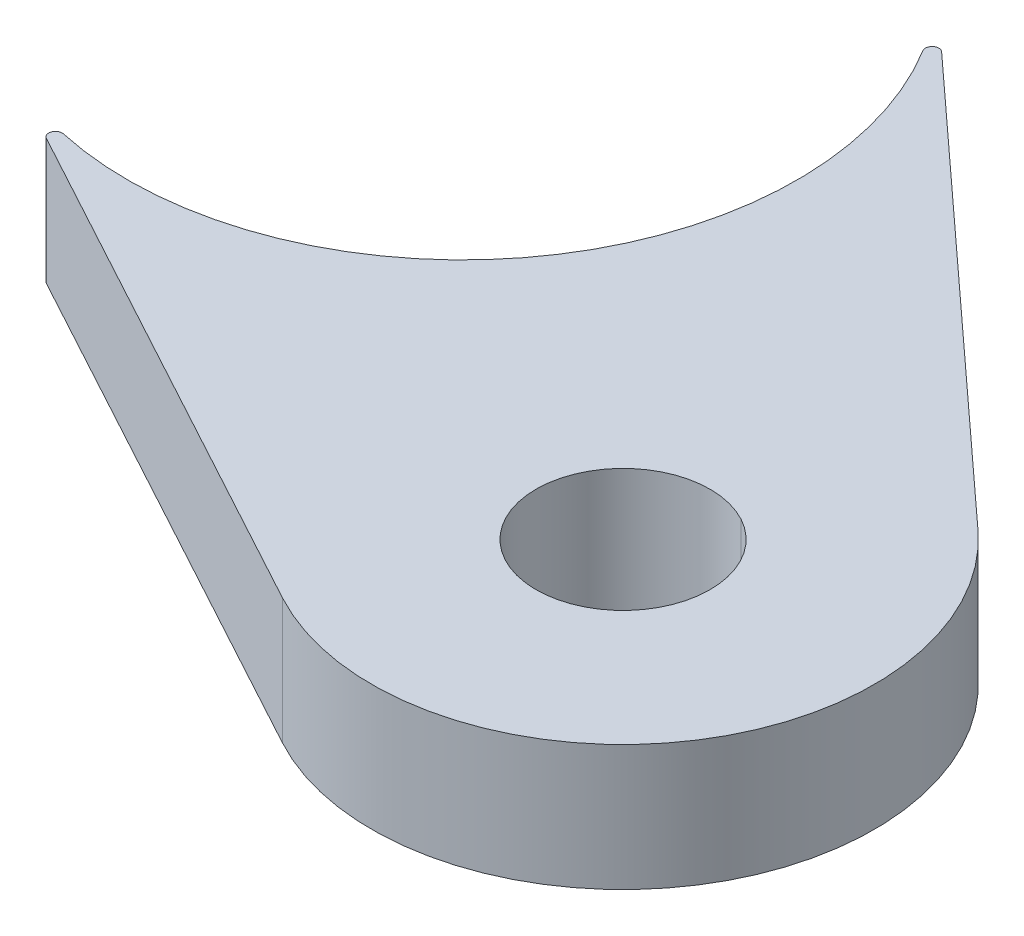
ISO-10303-21;
HEADER;
FILE_DESCRIPTION(('STEP AP214'),'2;1');
FILE_NAME('part.step','',(''),(''),'','','');
FILE_SCHEMA(('AUTOMOTIVE_DESIGN { 1 0 10303 214 1 1 1 1 }'));
ENDSEC;
DATA;
#1=APPLICATION_CONTEXT('core data for automotive mechanical design processes');
#2=APPLICATION_PROTOCOL_DEFINITION('international standard','automotive_design',2000,#1);
#3=PRODUCT_CONTEXT('',#1,'mechanical');
#4=PRODUCT('Part','Part','',(#3));
#5=PRODUCT_RELATED_PRODUCT_CATEGORY('part','',(#4));
#6=PRODUCT_DEFINITION_FORMATION('','',#4);
#7=PRODUCT_DEFINITION_CONTEXT('part definition',#1,'design');
#8=PRODUCT_DEFINITION('design','',#6,#7);
#9=PRODUCT_DEFINITION_SHAPE('','',#8);
#10=(LENGTH_UNIT() NAMED_UNIT(*) SI_UNIT(.MILLI.,.METRE.));
#11=(NAMED_UNIT(*) PLANE_ANGLE_UNIT() SI_UNIT($,.RADIAN.));
#12=(NAMED_UNIT(*) SI_UNIT($,.STERADIAN.) SOLID_ANGLE_UNIT());
#13=UNCERTAINTY_MEASURE_WITH_UNIT(LENGTH_MEASURE(1.E-05),#10,'distance_accuracy_value','');
#14=(GEOMETRIC_REPRESENTATION_CONTEXT(3) GLOBAL_UNCERTAINTY_ASSIGNED_CONTEXT((#13)) GLOBAL_UNIT_ASSIGNED_CONTEXT((#10,
#11,#12)) REPRESENTATION_CONTEXT('',''));
#15=CARTESIAN_POINT('',(0.,0.,0.));
#16=DIRECTION('',(0.,0.,1.));
#17=DIRECTION('',(1.,0.,0.));
#18=AXIS2_PLACEMENT_3D('',#15,#16,#17);
#19=CARTESIAN_POINT('',(21.2002725978992,4.7625,15.1119048029944));
#20=DIRECTION('',(0.,-1.,0.));
#21=DIRECTION('',(0.,0.,-1.));
#22=AXIS2_PLACEMENT_3D('',#19,#20,#21);
#23=CYLINDRICAL_SURFACE('',#22,3.29999999999998);
#24=CARTESIAN_POINT('',(21.2002725978992,4.7625,15.1119048029944));
#25=DIRECTION('',(0.,1.,0.));
#26=DIRECTION('',(0.,0.,1.));
#27=AXIS2_PLACEMENT_3D('',#24,#25,#26);
#28=CIRCLE('',#27,3.29999999999998);
#29=CARTESIAN_POINT('',(22.7737409759033,4.7625,12.2111812271566));
#30=VERTEX_POINT('',#29);
#31=CARTESIAN_POINT('',(19.6268042198951,4.7625,18.0126283788321));
#32=VERTEX_POINT('',#31);
#33=EDGE_CURVE('E159',#30,#32,#28,.T.);
#34=ORIENTED_EDGE('',*,*,#33,.T.);
#35=DIRECTION('',(0.,-1.,0.));
#36=VECTOR('',#35,1.);
#37=CARTESIAN_POINT('',(19.6268042198951,4.7625,18.0126283788321));
#38=LINE('',#37,#36);
#39=CARTESIAN_POINT('',(19.6268042198951,0.,18.0126283788321));
#40=VERTEX_POINT('',#39);
#41=EDGE_CURVE('E11',#32,#40,#38,.T.);
#42=ORIENTED_EDGE('',*,*,#41,.T.);
#43=CARTESIAN_POINT('',(21.2002725978992,0.,15.1119048029944));
#44=DIRECTION('',(0.,1.,0.));
#45=DIRECTION('',(0.,0.,1.));
#46=AXIS2_PLACEMENT_3D('',#43,#44,#45);
#47=CIRCLE('',#46,3.29999999999998);
#48=CARTESIAN_POINT('',(22.7737409759033,0.,12.2111812271566));
#49=VERTEX_POINT('',#48);
#50=EDGE_CURVE('E161',#49,#40,#47,.T.);
#51=ORIENTED_EDGE('',*,*,#50,.F.);
#52=DIRECTION('',(0.,1.,0.));
#53=VECTOR('',#52,1.);
#54=CARTESIAN_POINT('',(22.7737409759033,4.7625,12.2111812271566));
#55=LINE('',#54,#53);
#56=EDGE_CURVE('E51',#49,#30,#55,.T.);
#57=ORIENTED_EDGE('',*,*,#56,.T.);
#58=EDGE_LOOP('',(#34,#42,#51,#57));
#59=FACE_BOUND('',#58,.T.);
#60=ADVANCED_FACE('F42',(#59),#23,.F.);
#61=CARTESIAN_POINT('',(21.2002725978992,4.7625,15.1119048029944));
#62=DIRECTION('',(0.,-1.,0.));
#63=DIRECTION('',(0.,0.,-1.));
#64=AXIS2_PLACEMENT_3D('',#61,#62,#63);
#65=PLANE('',#64);
#66=DIRECTION('',(-0.737435012841057,0.,-0.675418094098841));
#67=VECTOR('',#66,1.);
#68=CARTESIAN_POINT('',(27.6336299441907,4.7625,8.0878363056833));
#69=LINE('',#68,#67);
#70=CARTESIAN_POINT('',(27.6336299441907,4.7625,8.0878363056833));
#71=VERTEX_POINT('',#70);
#72=CARTESIAN_POINT('',(11.2267519102379,4.7625,-6.93925367355661));
#73=VERTEX_POINT('',#72);
#74=EDGE_CURVE('E105',#71,#73,#69,.T.);
#75=ORIENTED_EDGE('',*,*,#74,.T.);
#76=CARTESIAN_POINT('',(11.0551957143368,4.7625,-6.75194518029498));
#77=DIRECTION('',(0.,-1.,0.));
#78=DIRECTION('',(0.,0.,-1.));
#79=AXIS2_PLACEMENT_3D('',#76,#77,#78);
#80=CIRCLE('',#79,0.254);
#81=CARTESIAN_POINT('',(10.8384271709185,4.7625,-6.61955409832841));
#82=VERTEX_POINT('',#81);
#83=EDGE_CURVE('E149',#73,#82,#80,.F.);
#84=ORIENTED_EDGE('',*,*,#83,.T.);
#85=CARTESIAN_POINT('',(0.,4.7625,0.));
#86=DIRECTION('',(0.,-1.,0.));
#87=DIRECTION('',(0.,0.,1.));
#88=AXIS2_PLACEMENT_3D('',#85,#86,#87);
#89=CIRCLE('',#88,12.7);
#90=CARTESIAN_POINT('',(-2.72242756199068,4.7625,12.4047727979884));
#91=VERTEX_POINT('',#90);
#92=EDGE_CURVE('E116',#82,#91,#89,.T.);
#93=ORIENTED_EDGE('',*,*,#92,.T.);
#94=CARTESIAN_POINT('',(-2.7768761132305,4.7625,12.6528682539482));
#95=DIRECTION('',(0.,-1.,0.));
#96=DIRECTION('',(0.,0.,-1.));
#97=AXIS2_PLACEMENT_3D('',#94,#95,#96);
#98=CIRCLE('',#97,0.254);
#99=CARTESIAN_POINT('',(-2.89798549747688,4.7625,12.8761360685733));
#100=VERTEX_POINT('',#99);
#101=EDGE_CURVE('E147',#91,#100,#98,.F.);
#102=ORIENTED_EDGE('',*,*,#101,.T.);
#103=DIRECTION('',(0.879007144193264,0.,0.47680859939519));
#104=VECTOR('',#103,1.);
#105=CARTESIAN_POINT('',(16.65867068866,4.7625,23.4844478514352));
#106=LINE('',#105,#104);
#107=CARTESIAN_POINT('',(16.65867068866,4.7625,23.4844478514352));
#108=VERTEX_POINT('',#107);
#109=EDGE_CURVE('E123',#100,#108,#106,.T.);
#110=ORIENTED_EDGE('',*,*,#109,.T.);
#111=CARTESIAN_POINT('',(21.2002725978992,4.7625,15.1119048029944));
#112=DIRECTION('',(0.,1.,0.));
#113=DIRECTION('',(0.,0.,-1.));
#114=AXIS2_PLACEMENT_3D('',#111,#112,#113);
#115=CIRCLE('',#114,9.525);
#116=EDGE_CURVE('E117',#108,#71,#115,.T.);
#117=ORIENTED_EDGE('',*,*,#116,.T.);
#118=EDGE_LOOP('',(#75,#84,#93,#102,#110,#117));
#119=FACE_BOUND('',#118,.T.);
#120=ORIENTED_EDGE('',*,*,#33,.F.);
#121=EDGE_CURVE('E162',#32,#30,#28,.T.);
#122=ORIENTED_EDGE('',*,*,#121,.F.);
#123=EDGE_LOOP('',(#120,#122));
#124=FACE_BOUND('',#123,.T.);
#125=ADVANCED_FACE('F120',(#119,#124),#65,.F.);
#126=CARTESIAN_POINT('',(21.2002725978992,0.,15.1119048029944));
#127=DIRECTION('',(0.,-1.,0.));
#128=DIRECTION('',(0.,0.,-1.));
#129=AXIS2_PLACEMENT_3D('',#126,#127,#128);
#130=PLANE('',#129);
#131=CARTESIAN_POINT('',(0.,0.,0.));
#132=DIRECTION('',(0.,-1.,0.));
#133=DIRECTION('',(0.,0.,1.));
#134=AXIS2_PLACEMENT_3D('',#131,#132,#133);
#135=CIRCLE('',#134,12.7);
#136=CARTESIAN_POINT('',(10.8384271709185,0.,-6.61955409832841));
#137=VERTEX_POINT('',#136);
#138=CARTESIAN_POINT('',(-2.72242756199068,0.,12.4047727979884));
#139=VERTEX_POINT('',#138);
#140=EDGE_CURVE('E173',#137,#139,#135,.T.);
#141=ORIENTED_EDGE('',*,*,#140,.F.);
#142=CARTESIAN_POINT('',(11.0551957143368,0.,-6.75194518029498));
#143=DIRECTION('',(0.,-1.,0.));
#144=DIRECTION('',(0.,0.,-1.));
#145=AXIS2_PLACEMENT_3D('',#142,#143,#144);
#146=CIRCLE('',#145,0.254);
#147=CARTESIAN_POINT('',(11.2267519102379,0.,-6.93925367355661));
#148=VERTEX_POINT('',#147);
#149=EDGE_CURVE('E144',#137,#148,#146,.T.);
#150=ORIENTED_EDGE('',*,*,#149,.T.);
#151=DIRECTION('',(-0.737435012841057,0.,-0.675418094098841));
#152=VECTOR('',#151,1.);
#153=CARTESIAN_POINT('',(27.6336299441907,0.,8.0878363056833));
#154=LINE('',#153,#152);
#155=CARTESIAN_POINT('',(27.6336299441907,0.,8.0878363056833));
#156=VERTEX_POINT('',#155);
#157=EDGE_CURVE('E164',#156,#148,#154,.T.);
#158=ORIENTED_EDGE('',*,*,#157,.F.);
#159=CARTESIAN_POINT('',(21.2002725978992,0.,15.1119048029944));
#160=DIRECTION('',(0.,1.,0.));
#161=DIRECTION('',(0.,0.,-1.));
#162=AXIS2_PLACEMENT_3D('',#159,#160,#161);
#163=CIRCLE('',#162,9.525);
#164=CARTESIAN_POINT('',(16.65867068866,0.,23.4844478514352));
#165=VERTEX_POINT('',#164);
#166=EDGE_CURVE('E131',#165,#156,#163,.T.);
#167=ORIENTED_EDGE('',*,*,#166,.F.);
#168=DIRECTION('',(0.879007144193264,0.,0.47680859939519));
#169=VECTOR('',#168,1.);
#170=CARTESIAN_POINT('',(16.65867068866,0.,23.4844478514352));
#171=LINE('',#170,#169);
#172=CARTESIAN_POINT('',(-2.89798549747688,0.,12.8761360685733));
#173=VERTEX_POINT('',#172);
#174=EDGE_CURVE('E127',#173,#165,#171,.T.);
#175=ORIENTED_EDGE('',*,*,#174,.F.);
#176=CARTESIAN_POINT('',(-2.7768761132305,0.,12.6528682539482));
#177=DIRECTION('',(0.,-1.,0.));
#178=DIRECTION('',(0.,0.,-1.));
#179=AXIS2_PLACEMENT_3D('',#176,#177,#178);
#180=CIRCLE('',#179,0.254);
#181=EDGE_CURVE('E142',#173,#139,#180,.T.);
#182=ORIENTED_EDGE('',*,*,#181,.T.);
#183=EDGE_LOOP('',(#141,#150,#158,#167,#175,#182));
#184=FACE_BOUND('',#183,.T.);
#185=ORIENTED_EDGE('',*,*,#50,.T.);
#186=EDGE_CURVE('E167',#40,#49,#47,.T.);
#187=ORIENTED_EDGE('',*,*,#186,.T.);
#188=EDGE_LOOP('',(#185,#187));
#189=FACE_BOUND('',#188,.T.);
#190=ADVANCED_FACE('F181',(#184,#189),#130,.T.);
#191=CARTESIAN_POINT('',(21.2002725978992,4.7625,15.1119048029944));
#192=DIRECTION('',(0.,-1.,0.));
#193=DIRECTION('',(0.,0.,-1.));
#194=AXIS2_PLACEMENT_3D('',#191,#192,#193);
#195=CYLINDRICAL_SURFACE('',#194,9.525);
#196=ORIENTED_EDGE('',*,*,#166,.T.);
#197=DIRECTION('',(0.,-1.,0.));
#198=VECTOR('',#197,1.);
#199=CARTESIAN_POINT('',(27.6336299441907,4.7625,8.0878363056833));
#200=LINE('',#199,#198);
#201=EDGE_CURVE('E110',#71,#156,#200,.T.);
#202=ORIENTED_EDGE('',*,*,#201,.F.);
#203=ORIENTED_EDGE('',*,*,#116,.F.);
#204=DIRECTION('',(0.,-1.,0.));
#205=VECTOR('',#204,1.);
#206=CARTESIAN_POINT('',(16.65867068866,4.7625,23.4844478514352));
#207=LINE('',#206,#205);
#208=EDGE_CURVE('E133',#108,#165,#207,.T.);
#209=ORIENTED_EDGE('',*,*,#208,.T.);
#210=EDGE_LOOP('',(#196,#202,#203,#209));
#211=FACE_BOUND('',#210,.T.);
#212=ADVANCED_FACE('F129',(#211),#195,.T.);
#213=CARTESIAN_POINT('',(27.6336299441907,4.7625,8.0878363056833));
#214=DIRECTION('',(-0.675418094098841,0.,0.737435012841057));
#215=DIRECTION('',(0.737435012841057,0.,0.675418094098841));
#216=AXIS2_PLACEMENT_3D('',#213,#214,#215);
#217=PLANE('',#216);
#218=ORIENTED_EDGE('',*,*,#157,.T.);
#219=DIRECTION('',(0.,-1.,0.));
#220=VECTOR('',#219,1.);
#221=CARTESIAN_POINT('',(11.2267519102379,4.7625,-6.93925367355661));
#222=LINE('',#221,#220);
#223=EDGE_CURVE('E113',#148,#73,#222,.F.);
#224=ORIENTED_EDGE('',*,*,#223,.T.);
#225=ORIENTED_EDGE('',*,*,#74,.F.);
#226=ORIENTED_EDGE('',*,*,#201,.T.);
#227=EDGE_LOOP('',(#218,#224,#225,#226));
#228=FACE_BOUND('',#227,.T.);
#229=ADVANCED_FACE('F108',(#228),#217,.F.);
#230=CARTESIAN_POINT('',(0.,4.7625,0.));
#231=DIRECTION('',(0.,-1.,0.));
#232=DIRECTION('',(0.,0.,-1.));
#233=AXIS2_PLACEMENT_3D('',#230,#231,#232);
#234=CYLINDRICAL_SURFACE('',#233,12.7);
#235=ORIENTED_EDGE('',*,*,#92,.F.);
#236=DIRECTION('',(0.,-1.,0.));
#237=VECTOR('',#236,1.);
#238=CARTESIAN_POINT('',(10.8384271709185,4.7625,-6.61955409832841));
#239=LINE('',#238,#237);
#240=EDGE_CURVE('E135',#82,#137,#239,.T.);
#241=ORIENTED_EDGE('',*,*,#240,.T.);
#242=ORIENTED_EDGE('',*,*,#140,.T.);
#243=DIRECTION('',(0.,-1.,0.));
#244=VECTOR('',#243,1.);
#245=CARTESIAN_POINT('',(-2.72242756199068,4.7625,12.4047727979884));
#246=LINE('',#245,#244);
#247=EDGE_CURVE('E132',#139,#91,#246,.F.);
#248=ORIENTED_EDGE('',*,*,#247,.T.);
#249=EDGE_LOOP('',(#235,#241,#242,#248));
#250=FACE_BOUND('',#249,.T.);
#251=ADVANCED_FACE('F189',(#250),#234,.F.);
#252=CARTESIAN_POINT('',(16.65867068866,4.7625,23.4844478514352));
#253=DIRECTION('',(0.47680859939519,0.,-0.879007144193264));
#254=DIRECTION('',(-0.879007144193264,0.,-0.47680859939519));
#255=AXIS2_PLACEMENT_3D('',#252,#253,#254);
#256=PLANE('',#255);
#257=ORIENTED_EDGE('',*,*,#109,.F.);
#258=DIRECTION('',(0.,-1.,0.));
#259=VECTOR('',#258,1.);
#260=CARTESIAN_POINT('',(-2.89798549747687,4.7625,12.8761360685733));
#261=LINE('',#260,#259);
#262=EDGE_CURVE('E151',#100,#173,#261,.T.);
#263=ORIENTED_EDGE('',*,*,#262,.T.);
#264=ORIENTED_EDGE('',*,*,#174,.T.);
#265=ORIENTED_EDGE('',*,*,#208,.F.);
#266=EDGE_LOOP('',(#257,#263,#264,#265));
#267=FACE_BOUND('',#266,.T.);
#268=ADVANCED_FACE('F177',(#267),#256,.F.);
#269=ORIENTED_EDGE('',*,*,#41,.F.);
#270=ORIENTED_EDGE('',*,*,#121,.T.);
#271=ORIENTED_EDGE('',*,*,#56,.F.);
#272=ORIENTED_EDGE('',*,*,#186,.F.);
#273=EDGE_LOOP('',(#269,#270,#271,#272));
#274=FACE_BOUND('',#273,.T.);
#275=ADVANCED_FACE('F197',(#274),#23,.F.);
#276=CARTESIAN_POINT('',(11.0551957143368,4.7625,-6.75194518029498));
#277=DIRECTION('',(0.,-1.,0.));
#278=DIRECTION('',(0.,0.,-1.));
#279=AXIS2_PLACEMENT_3D('',#276,#277,#278);
#280=CYLINDRICAL_SURFACE('',#279,0.254);
#281=ORIENTED_EDGE('',*,*,#83,.F.);
#282=ORIENTED_EDGE('',*,*,#223,.F.);
#283=ORIENTED_EDGE('',*,*,#149,.F.);
#284=ORIENTED_EDGE('',*,*,#240,.F.);
#285=EDGE_LOOP('',(#281,#282,#283,#284));
#286=FACE_BOUND('',#285,.T.);
#287=ADVANCED_FACE('F184',(#286),#280,.T.);
#288=CARTESIAN_POINT('',(-2.7768761132305,4.7625,12.6528682539482));
#289=DIRECTION('',(0.,-1.,0.));
#290=DIRECTION('',(0.,0.,-1.));
#291=AXIS2_PLACEMENT_3D('',#288,#289,#290);
#292=CYLINDRICAL_SURFACE('',#291,0.254);
#293=ORIENTED_EDGE('',*,*,#101,.F.);
#294=ORIENTED_EDGE('',*,*,#247,.F.);
#295=ORIENTED_EDGE('',*,*,#181,.F.);
#296=ORIENTED_EDGE('',*,*,#262,.F.);
#297=EDGE_LOOP('',(#293,#294,#295,#296));
#298=FACE_BOUND('',#297,.T.);
#299=ADVANCED_FACE('F44',(#298),#292,.T.);
#300=CLOSED_SHELL('',(#60,#125,#190,#212,#229,#251,#268,#275,#287,#299));
#301=MANIFOLD_SOLID_BREP('B2',#300);
#302=ADVANCED_BREP_SHAPE_REPRESENTATION('',(#18,#301),#14);
#303=SHAPE_DEFINITION_REPRESENTATION(#9,#302);
ENDSEC;
END-ISO-10303-21;
